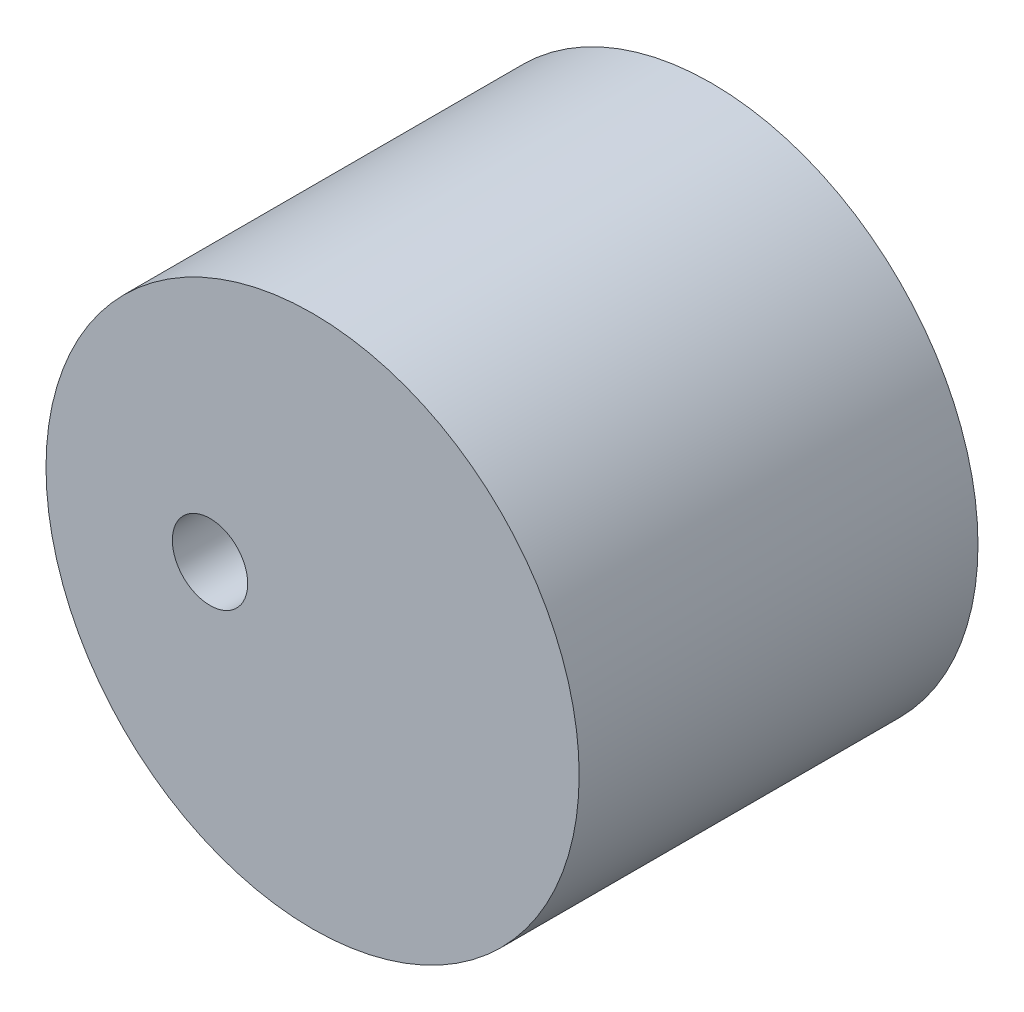
ISO-10303-21;
HEADER;
FILE_DESCRIPTION(('STEP AP214'),'2;1');
FILE_NAME('part.step','',(''),(''),'','','');
FILE_SCHEMA(('AUTOMOTIVE_DESIGN { 1 0 10303 214 1 1 1 1 }'));
ENDSEC;
DATA;
#1=APPLICATION_CONTEXT('core data for automotive mechanical design processes');
#2=APPLICATION_PROTOCOL_DEFINITION('international standard','automotive_design',2000,#1);
#3=PRODUCT_CONTEXT('',#1,'mechanical');
#4=PRODUCT('Part','Part','',(#3));
#5=PRODUCT_RELATED_PRODUCT_CATEGORY('part','',(#4));
#6=PRODUCT_DEFINITION_FORMATION('','',#4);
#7=PRODUCT_DEFINITION_CONTEXT('part definition',#1,'design');
#8=PRODUCT_DEFINITION('design','',#6,#7);
#9=PRODUCT_DEFINITION_SHAPE('','',#8);
#10=(LENGTH_UNIT() NAMED_UNIT(*) SI_UNIT(.MILLI.,.METRE.));
#11=(NAMED_UNIT(*) PLANE_ANGLE_UNIT() SI_UNIT($,.RADIAN.));
#12=(NAMED_UNIT(*) SI_UNIT($,.STERADIAN.) SOLID_ANGLE_UNIT());
#13=UNCERTAINTY_MEASURE_WITH_UNIT(LENGTH_MEASURE(1.E-05),#10,'distance_accuracy_value','');
#14=(GEOMETRIC_REPRESENTATION_CONTEXT(3) GLOBAL_UNCERTAINTY_ASSIGNED_CONTEXT((#13)) GLOBAL_UNIT_ASSIGNED_CONTEXT((#10,
#11,#12)) REPRESENTATION_CONTEXT('',''));
#15=CARTESIAN_POINT('',(0.,0.,0.));
#16=DIRECTION('',(0.,0.,1.));
#17=DIRECTION('',(1.,0.,0.));
#18=AXIS2_PLACEMENT_3D('',#15,#16,#17);
#19=CARTESIAN_POINT('',(0.,0.,35.));
#20=DIRECTION('',(0.,0.,1.));
#21=DIRECTION('',(1.,0.,0.));
#22=AXIS2_PLACEMENT_3D('',#19,#20,#21);
#23=PLANE('',#22);
#24=CARTESIAN_POINT('',(0.,0.,35.));
#25=DIRECTION('',(0.,0.,1.));
#26=DIRECTION('',(1.,0.,0.));
#27=AXIS2_PLACEMENT_3D('',#24,#25,#26);
#28=CIRCLE('',#27,23.39375);
#29=CARTESIAN_POINT('',(23.39375,0.,35.));
#30=VERTEX_POINT('',#29);
#31=EDGE_CURVE('E10',#30,#30,#28,.T.);
#32=ORIENTED_EDGE('',*,*,#31,.T.);
#33=EDGE_LOOP('',(#32));
#34=FACE_BOUND('',#33,.T.);
#35=CARTESIAN_POINT('',(-9.,0.,35.));
#36=DIRECTION('',(0.,0.,1.));
#37=DIRECTION('',(1.,0.,0.));
#38=AXIS2_PLACEMENT_3D('',#35,#36,#37);
#39=CIRCLE('',#38,3.3085);
#40=CARTESIAN_POINT('',(-5.6915,0.,35.));
#41=VERTEX_POINT('',#40);
#42=EDGE_CURVE('E50',#41,#41,#39,.T.);
#43=ORIENTED_EDGE('',*,*,#42,.F.);
#44=EDGE_LOOP('',(#43));
#45=FACE_BOUND('',#44,.T.);
#46=ADVANCED_FACE('F37',(#34,#45),#23,.T.);
#47=CARTESIAN_POINT('',(0.,0.,0.));
#48=DIRECTION('',(0.,0.,1.));
#49=DIRECTION('',(1.,0.,0.));
#50=AXIS2_PLACEMENT_3D('',#47,#48,#49);
#51=PLANE('',#50);
#52=CARTESIAN_POINT('',(0.,0.,0.));
#53=DIRECTION('',(0.,0.,1.));
#54=DIRECTION('',(1.,0.,0.));
#55=AXIS2_PLACEMENT_3D('',#52,#53,#54);
#56=CIRCLE('',#55,23.39375);
#57=CARTESIAN_POINT('',(23.39375,0.,0.));
#58=VERTEX_POINT('',#57);
#59=EDGE_CURVE('E41',#58,#58,#56,.T.);
#60=ORIENTED_EDGE('',*,*,#59,.F.);
#61=EDGE_LOOP('',(#60));
#62=FACE_BOUND('',#61,.T.);
#63=CARTESIAN_POINT('',(-9.,0.,0.));
#64=DIRECTION('',(0.,0.,1.));
#65=DIRECTION('',(1.,0.,0.));
#66=AXIS2_PLACEMENT_3D('',#63,#64,#65);
#67=CIRCLE('',#66,3.3085);
#68=CARTESIAN_POINT('',(-5.6915,0.,0.));
#69=VERTEX_POINT('',#68);
#70=EDGE_CURVE('E52',#69,#69,#67,.T.);
#71=ORIENTED_EDGE('',*,*,#70,.T.);
#72=EDGE_LOOP('',(#71));
#73=FACE_BOUND('',#72,.T.);
#74=ADVANCED_FACE('F64',(#62,#73),#51,.F.);
#75=CARTESIAN_POINT('',(0.,0.,35.));
#76=DIRECTION('',(0.,0.,-1.));
#77=DIRECTION('',(-1.,0.,0.));
#78=AXIS2_PLACEMENT_3D('',#75,#76,#77);
#79=CYLINDRICAL_SURFACE('',#78,23.39375);
#80=ORIENTED_EDGE('',*,*,#31,.F.);
#81=EDGE_LOOP('',(#80));
#82=FACE_BOUND('',#81,.T.);
#83=ORIENTED_EDGE('',*,*,#59,.T.);
#84=EDGE_LOOP('',(#83));
#85=FACE_BOUND('',#84,.T.);
#86=ADVANCED_FACE('F39',(#82,#85),#79,.T.);
#87=CARTESIAN_POINT('',(-9.,0.,35.));
#88=DIRECTION('',(0.,0.,-1.));
#89=DIRECTION('',(-1.,0.,0.));
#90=AXIS2_PLACEMENT_3D('',#87,#88,#89);
#91=CYLINDRICAL_SURFACE('',#90,3.3085);
#92=ORIENTED_EDGE('',*,*,#42,.T.);
#93=EDGE_LOOP('',(#92));
#94=FACE_BOUND('',#93,.T.);
#95=ORIENTED_EDGE('',*,*,#70,.F.);
#96=EDGE_LOOP('',(#95));
#97=FACE_BOUND('',#96,.T.);
#98=ADVANCED_FACE('F60',(#94,#97),#91,.F.);
#99=CLOSED_SHELL('',(#46,#74,#86,#98));
#100=MANIFOLD_SOLID_BREP('B2',#99);
#101=ADVANCED_BREP_SHAPE_REPRESENTATION('',(#18,#100),#14);
#102=SHAPE_DEFINITION_REPRESENTATION(#9,#101);
ENDSEC;
END-ISO-10303-21;
